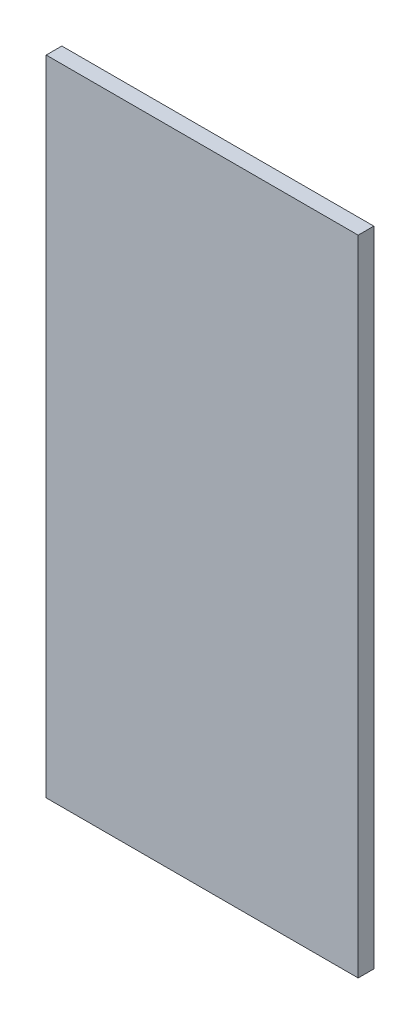
ISO-10303-21;
HEADER;
FILE_DESCRIPTION(('STEP AP214'),'2;1');
FILE_NAME('part.step','',(''),(''),'','','');
FILE_SCHEMA(('AUTOMOTIVE_DESIGN { 1 0 10303 214 1 1 1 1 }'));
ENDSEC;
DATA;
#1=APPLICATION_CONTEXT('core data for automotive mechanical design processes');
#2=APPLICATION_PROTOCOL_DEFINITION('international standard','automotive_design',2000,#1);
#3=PRODUCT_CONTEXT('',#1,'mechanical');
#4=PRODUCT('Part','Part','',(#3));
#5=PRODUCT_RELATED_PRODUCT_CATEGORY('part','',(#4));
#6=PRODUCT_DEFINITION_FORMATION('','',#4);
#7=PRODUCT_DEFINITION_CONTEXT('part definition',#1,'design');
#8=PRODUCT_DEFINITION('design','',#6,#7);
#9=PRODUCT_DEFINITION_SHAPE('','',#8);
#10=(LENGTH_UNIT() NAMED_UNIT(*) SI_UNIT(.MILLI.,.METRE.));
#11=(NAMED_UNIT(*) PLANE_ANGLE_UNIT() SI_UNIT($,.RADIAN.));
#12=(NAMED_UNIT(*) SI_UNIT($,.STERADIAN.) SOLID_ANGLE_UNIT());
#13=UNCERTAINTY_MEASURE_WITH_UNIT(LENGTH_MEASURE(1.E-05),#10,'distance_accuracy_value','');
#14=(GEOMETRIC_REPRESENTATION_CONTEXT(3) GLOBAL_UNCERTAINTY_ASSIGNED_CONTEXT((#13)) GLOBAL_UNIT_ASSIGNED_CONTEXT((#10,
#11,#12)) REPRESENTATION_CONTEXT('',''));
#15=CARTESIAN_POINT('',(0.,0.,0.));
#16=DIRECTION('',(0.,0.,1.));
#17=DIRECTION('',(1.,0.,0.));
#18=AXIS2_PLACEMENT_3D('',#15,#16,#17);
#19=CARTESIAN_POINT('',(57.15,117.856,5.732800066));
#20=DIRECTION('',(-1.,0.,0.));
#21=DIRECTION('',(0.,-1.,0.));
#22=AXIS2_PLACEMENT_3D('',#19,#20,#21);
#23=PLANE('',#22);
#24=DIRECTION('',(0.,1.,0.));
#25=VECTOR('',#24,1.);
#26=CARTESIAN_POINT('',(57.15,117.856,0.));
#27=LINE('',#26,#25);
#28=CARTESIAN_POINT('',(57.15,-117.856,0.));
#29=VERTEX_POINT('',#28);
#30=CARTESIAN_POINT('',(57.15,117.856,0.));
#31=VERTEX_POINT('',#30);
#32=EDGE_CURVE('E95',#29,#31,#27,.T.);
#33=ORIENTED_EDGE('',*,*,#32,.T.);
#34=DIRECTION('',(0.,0.,-1.));
#35=VECTOR('',#34,1.);
#36=CARTESIAN_POINT('',(57.15,117.856,5.732800066));
#37=LINE('',#36,#35);
#38=CARTESIAN_POINT('',(57.15,117.856,5.732800066));
#39=VERTEX_POINT('',#38);
#40=EDGE_CURVE('E11',#39,#31,#37,.T.);
#41=ORIENTED_EDGE('',*,*,#40,.F.);
#42=DIRECTION('',(0.,1.,0.));
#43=VECTOR('',#42,1.);
#44=CARTESIAN_POINT('',(57.15,117.856,5.732800066));
#45=LINE('',#44,#43);
#46=CARTESIAN_POINT('',(57.15,-117.856,5.732800066));
#47=VERTEX_POINT('',#46);
#48=EDGE_CURVE('E83',#47,#39,#45,.T.);
#49=ORIENTED_EDGE('',*,*,#48,.F.);
#50=DIRECTION('',(0.,0.,-1.));
#51=VECTOR('',#50,1.);
#52=CARTESIAN_POINT('',(57.15,-117.856,5.732800066));
#53=LINE('',#52,#51);
#54=EDGE_CURVE('E91',#47,#29,#53,.T.);
#55=ORIENTED_EDGE('',*,*,#54,.T.);
#56=EDGE_LOOP('',(#33,#41,#49,#55));
#57=FACE_BOUND('',#56,.T.);
#58=ADVANCED_FACE('F32',(#57),#23,.F.);
#59=CARTESIAN_POINT('',(-57.15,117.856,5.732800066));
#60=DIRECTION('',(0.,-1.,0.));
#61=DIRECTION('',(0.,0.,-1.));
#62=AXIS2_PLACEMENT_3D('',#59,#60,#61);
#63=PLANE('',#62);
#64=DIRECTION('',(-1.,0.,0.));
#65=VECTOR('',#64,1.);
#66=CARTESIAN_POINT('',(-57.15,117.856,0.));
#67=LINE('',#66,#65);
#68=CARTESIAN_POINT('',(-57.15,117.856,0.));
#69=VERTEX_POINT('',#68);
#70=EDGE_CURVE('E87',#31,#69,#67,.T.);
#71=ORIENTED_EDGE('',*,*,#70,.T.);
#72=DIRECTION('',(0.,0.,-1.));
#73=VECTOR('',#72,1.);
#74=CARTESIAN_POINT('',(-57.15,117.856,5.732800066));
#75=LINE('',#74,#73);
#76=CARTESIAN_POINT('',(-57.15,117.856,5.732800066));
#77=VERTEX_POINT('',#76);
#78=EDGE_CURVE('E40',#77,#69,#75,.T.);
#79=ORIENTED_EDGE('',*,*,#78,.F.);
#80=DIRECTION('',(-1.,0.,0.));
#81=VECTOR('',#80,1.);
#82=CARTESIAN_POINT('',(-57.15,117.856,5.732800066));
#83=LINE('',#82,#81);
#84=EDGE_CURVE('E78',#39,#77,#83,.T.);
#85=ORIENTED_EDGE('',*,*,#84,.F.);
#86=ORIENTED_EDGE('',*,*,#40,.T.);
#87=EDGE_LOOP('',(#71,#79,#85,#86));
#88=FACE_BOUND('',#87,.T.);
#89=ADVANCED_FACE('F86',(#88),#63,.F.);
#90=CARTESIAN_POINT('',(-57.15,117.856,5.732800066));
#91=DIRECTION('',(1.,0.,0.));
#92=DIRECTION('',(0.,1.,0.));
#93=AXIS2_PLACEMENT_3D('',#90,#91,#92);
#94=PLANE('',#93);
#95=DIRECTION('',(0.,-1.,0.));
#96=VECTOR('',#95,1.);
#97=CARTESIAN_POINT('',(-57.15,117.856,0.));
#98=LINE('',#97,#96);
#99=CARTESIAN_POINT('',(-57.15,-117.856,0.));
#100=VERTEX_POINT('',#99);
#101=EDGE_CURVE('E65',#69,#100,#98,.T.);
#102=ORIENTED_EDGE('',*,*,#101,.T.);
#103=DIRECTION('',(0.,0.,-1.));
#104=VECTOR('',#103,1.);
#105=CARTESIAN_POINT('',(-57.15,-117.856,5.732800066));
#106=LINE('',#105,#104);
#107=CARTESIAN_POINT('',(-57.15,-117.856,5.732800066));
#108=VERTEX_POINT('',#107);
#109=EDGE_CURVE('E88',#108,#100,#106,.T.);
#110=ORIENTED_EDGE('',*,*,#109,.F.);
#111=DIRECTION('',(0.,-1.,0.));
#112=VECTOR('',#111,1.);
#113=CARTESIAN_POINT('',(-57.15,117.856,5.732800066));
#114=LINE('',#113,#112);
#115=EDGE_CURVE('E81',#77,#108,#114,.T.);
#116=ORIENTED_EDGE('',*,*,#115,.F.);
#117=ORIENTED_EDGE('',*,*,#78,.T.);
#118=EDGE_LOOP('',(#102,#110,#116,#117));
#119=FACE_BOUND('',#118,.T.);
#120=ADVANCED_FACE('F89',(#119),#94,.F.);
#121=CARTESIAN_POINT('',(-57.15,-117.856,5.732800066));
#122=DIRECTION('',(0.,1.,0.));
#123=DIRECTION('',(0.,0.,1.));
#124=AXIS2_PLACEMENT_3D('',#121,#122,#123);
#125=PLANE('',#124);
#126=DIRECTION('',(1.,0.,0.));
#127=VECTOR('',#126,1.);
#128=CARTESIAN_POINT('',(-57.15,-117.856,0.));
#129=LINE('',#128,#127);
#130=EDGE_CURVE('E71',#100,#29,#129,.T.);
#131=ORIENTED_EDGE('',*,*,#130,.T.);
#132=ORIENTED_EDGE('',*,*,#54,.F.);
#133=DIRECTION('',(1.,0.,0.));
#134=VECTOR('',#133,1.);
#135=CARTESIAN_POINT('',(-57.15,-117.856,5.732800066));
#136=LINE('',#135,#134);
#137=EDGE_CURVE('E48',#108,#47,#136,.T.);
#138=ORIENTED_EDGE('',*,*,#137,.F.);
#139=ORIENTED_EDGE('',*,*,#109,.T.);
#140=EDGE_LOOP('',(#131,#132,#138,#139));
#141=FACE_BOUND('',#140,.T.);
#142=ADVANCED_FACE('F102',(#141),#125,.F.);
#143=CARTESIAN_POINT('',(0.,0.,5.732800066));
#144=DIRECTION('',(0.,0.,1.));
#145=DIRECTION('',(1.,0.,0.));
#146=AXIS2_PLACEMENT_3D('',#143,#144,#145);
#147=PLANE('',#146);
#148=ORIENTED_EDGE('',*,*,#48,.T.);
#149=ORIENTED_EDGE('',*,*,#84,.T.);
#150=ORIENTED_EDGE('',*,*,#115,.T.);
#151=ORIENTED_EDGE('',*,*,#137,.T.);
#152=EDGE_LOOP('',(#148,#149,#150,#151));
#153=FACE_BOUND('',#152,.T.);
#154=ADVANCED_FACE('F79',(#153),#147,.T.);
#155=CARTESIAN_POINT('',(0.,0.,0.));
#156=DIRECTION('',(0.,0.,1.));
#157=DIRECTION('',(1.,0.,0.));
#158=AXIS2_PLACEMENT_3D('',#155,#156,#157);
#159=PLANE('',#158);
#160=ORIENTED_EDGE('',*,*,#32,.F.);
#161=ORIENTED_EDGE('',*,*,#130,.F.);
#162=ORIENTED_EDGE('',*,*,#101,.F.);
#163=ORIENTED_EDGE('',*,*,#70,.F.);
#164=EDGE_LOOP('',(#160,#161,#162,#163));
#165=FACE_BOUND('',#164,.T.);
#166=ADVANCED_FACE('F105',(#165),#159,.F.);
#167=CLOSED_SHELL('',(#58,#89,#120,#142,#154,#166));
#168=MANIFOLD_SOLID_BREP('B2',#167);
#169=ADVANCED_BREP_SHAPE_REPRESENTATION('',(#18,#168),#14);
#170=SHAPE_DEFINITION_REPRESENTATION(#9,#169);
ENDSEC;
END-ISO-10303-21;
